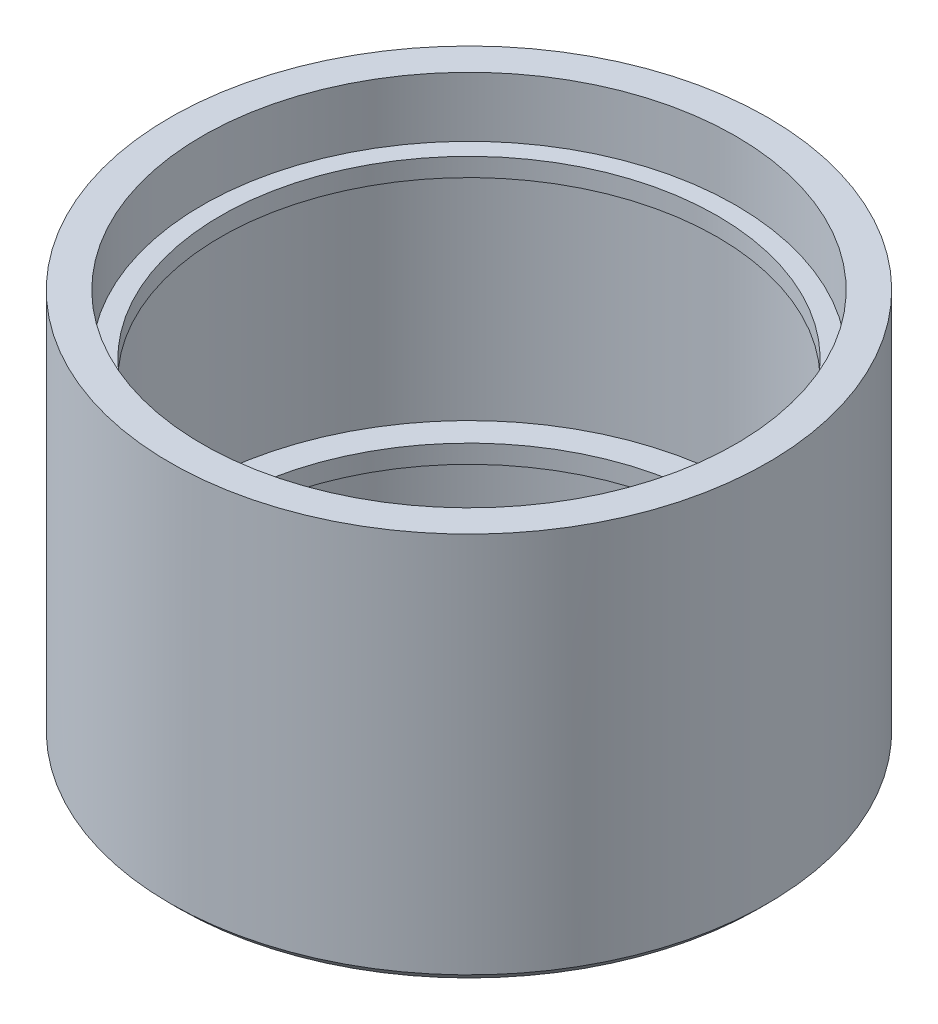
ISO-10303-21;
HEADER;
FILE_DESCRIPTION(('STEP AP214'),'2;1');
FILE_NAME('part.step','',(''),(''),'','','');
FILE_SCHEMA(('AUTOMOTIVE_DESIGN { 1 0 10303 214 1 1 1 1 }'));
ENDSEC;
DATA;
#1=APPLICATION_CONTEXT('core data for automotive mechanical design processes');
#2=APPLICATION_PROTOCOL_DEFINITION('international standard','automotive_design',2000,#1);
#3=PRODUCT_CONTEXT('',#1,'mechanical');
#4=PRODUCT('Part','Part','',(#3));
#5=PRODUCT_RELATED_PRODUCT_CATEGORY('part','',(#4));
#6=PRODUCT_DEFINITION_FORMATION('','',#4);
#7=PRODUCT_DEFINITION_CONTEXT('part definition',#1,'design');
#8=PRODUCT_DEFINITION('design','',#6,#7);
#9=PRODUCT_DEFINITION_SHAPE('','',#8);
#10=(LENGTH_UNIT() NAMED_UNIT(*) SI_UNIT(.MILLI.,.METRE.));
#11=(NAMED_UNIT(*) PLANE_ANGLE_UNIT() SI_UNIT($,.RADIAN.));
#12=(NAMED_UNIT(*) SI_UNIT($,.STERADIAN.) SOLID_ANGLE_UNIT());
#13=UNCERTAINTY_MEASURE_WITH_UNIT(LENGTH_MEASURE(1.E-05),#10,'distance_accuracy_value','');
#14=(GEOMETRIC_REPRESENTATION_CONTEXT(3) GLOBAL_UNCERTAINTY_ASSIGNED_CONTEXT((#13)) GLOBAL_UNIT_ASSIGNED_CONTEXT((#10,
#11,#12)) REPRESENTATION_CONTEXT('',''));
#15=CARTESIAN_POINT('',(0.,0.,0.));
#16=DIRECTION('',(0.,0.,1.));
#17=DIRECTION('',(1.,0.,0.));
#18=AXIS2_PLACEMENT_3D('',#15,#16,#17);
#19=CARTESIAN_POINT('',(0.,-21.25,29.));
#20=DIRECTION('',(0.,1.,0.));
#21=DIRECTION('',(0.,0.,1.));
#22=AXIS2_PLACEMENT_3D('',#19,#20,#21);
#23=PLANE('',#22);
#24=CARTESIAN_POINT('',(0.,-21.25,0.));
#25=DIRECTION('',(0.,1.,0.));
#26=DIRECTION('',(0.,0.,1.));
#27=AXIS2_PLACEMENT_3D('',#24,#25,#26);
#28=CIRCLE('',#27,31.5);
#29=CARTESIAN_POINT('',(0.,-21.25,31.5));
#30=VERTEX_POINT('',#29);
#31=EDGE_CURVE('E43',#30,#30,#28,.F.);
#32=ORIENTED_EDGE('',*,*,#31,.T.);
#33=EDGE_LOOP('',(#32));
#34=FACE_BOUND('',#33,.T.);
#35=CARTESIAN_POINT('',(0.,-21.25,0.));
#36=DIRECTION('',(0.,-1.,0.));
#37=DIRECTION('',(0.,0.,-1.));
#38=AXIS2_PLACEMENT_3D('',#35,#36,#37);
#39=CIRCLE('',#38,29.);
#40=CARTESIAN_POINT('',(0.,-21.25,-29.));
#41=VERTEX_POINT('',#40);
#42=EDGE_CURVE('E80',#41,#41,#39,.T.);
#43=ORIENTED_EDGE('',*,*,#42,.F.);
#44=EDGE_LOOP('',(#43));
#45=FACE_BOUND('',#44,.T.);
#46=ADVANCED_FACE('F36',(#34,#45),#23,.F.);
#47=CARTESIAN_POINT('',(0.,-21.25,0.));
#48=DIRECTION('',(0.,-1.,0.));
#49=DIRECTION('',(0.,0.,-1.));
#50=AXIS2_PLACEMENT_3D('',#47,#48,#49);
#51=CYLINDRICAL_SURFACE('',#50,32.5);
#52=CARTESIAN_POINT('',(0.,-20.25,0.));
#53=DIRECTION('',(0.,1.,0.));
#54=DIRECTION('',(0.,0.,1.));
#55=AXIS2_PLACEMENT_3D('',#52,#53,#54);
#56=CIRCLE('',#55,32.5);
#57=CARTESIAN_POINT('',(0.,-20.25,32.5));
#58=VERTEX_POINT('',#57);
#59=EDGE_CURVE('E10',#58,#58,#56,.T.);
#60=ORIENTED_EDGE('',*,*,#59,.T.);
#61=EDGE_LOOP('',(#60));
#62=FACE_BOUND('',#61,.T.);
#63=CARTESIAN_POINT('',(0.,21.25,0.));
#64=DIRECTION('',(0.,-1.,0.));
#65=DIRECTION('',(0.,0.,-1.));
#66=AXIS2_PLACEMENT_3D('',#63,#64,#65);
#67=CIRCLE('',#66,32.5);
#68=CARTESIAN_POINT('',(0.,21.25,-32.5));
#69=VERTEX_POINT('',#68);
#70=EDGE_CURVE('E47',#69,#69,#67,.T.);
#71=ORIENTED_EDGE('',*,*,#70,.T.);
#72=EDGE_LOOP('',(#71));
#73=FACE_BOUND('',#72,.T.);
#74=ADVANCED_FACE('F87',(#62,#73),#51,.T.);
#75=CARTESIAN_POINT('',(0.,21.25,32.5));
#76=DIRECTION('',(0.,-1.,0.));
#77=DIRECTION('',(0.,0.,-1.));
#78=AXIS2_PLACEMENT_3D('',#75,#76,#77);
#79=PLANE('',#78);
#80=ORIENTED_EDGE('',*,*,#70,.F.);
#81=EDGE_LOOP('',(#80));
#82=FACE_BOUND('',#81,.T.);
#83=CARTESIAN_POINT('',(0.,21.25,0.));
#84=DIRECTION('',(0.,-1.,0.));
#85=DIRECTION('',(0.,0.,-1.));
#86=AXIS2_PLACEMENT_3D('',#83,#84,#85);
#87=CIRCLE('',#86,29.);
#88=CARTESIAN_POINT('',(0.,21.25,-29.));
#89=VERTEX_POINT('',#88);
#90=EDGE_CURVE('E51',#89,#89,#87,.T.);
#91=ORIENTED_EDGE('',*,*,#90,.T.);
#92=EDGE_LOOP('',(#91));
#93=FACE_BOUND('',#92,.T.);
#94=ADVANCED_FACE('F91',(#82,#93),#79,.F.);
#95=CARTESIAN_POINT('',(0.,-21.25,0.));
#96=DIRECTION('',(0.,-1.,0.));
#97=DIRECTION('',(0.,0.,-1.));
#98=AXIS2_PLACEMENT_3D('',#95,#96,#97);
#99=CYLINDRICAL_SURFACE('',#98,29.);
#100=ORIENTED_EDGE('',*,*,#90,.F.);
#101=EDGE_LOOP('',(#100));
#102=FACE_BOUND('',#101,.T.);
#103=CARTESIAN_POINT('',(0.,14.75,0.));
#104=DIRECTION('',(0.,-1.,0.));
#105=DIRECTION('',(0.,0.,-1.));
#106=AXIS2_PLACEMENT_3D('',#103,#104,#105);
#107=CIRCLE('',#106,29.);
#108=CARTESIAN_POINT('',(0.,14.75,-29.));
#109=VERTEX_POINT('',#108);
#110=EDGE_CURVE('E56',#109,#109,#107,.T.);
#111=ORIENTED_EDGE('',*,*,#110,.T.);
#112=EDGE_LOOP('',(#111));
#113=FACE_BOUND('',#112,.T.);
#114=ADVANCED_FACE('F96',(#102,#113),#99,.F.);
#115=CARTESIAN_POINT('',(0.,14.75,29.));
#116=DIRECTION('',(0.,-1.,0.));
#117=DIRECTION('',(0.,0.,-1.));
#118=AXIS2_PLACEMENT_3D('',#115,#116,#117);
#119=PLANE('',#118);
#120=ORIENTED_EDGE('',*,*,#110,.F.);
#121=EDGE_LOOP('',(#120));
#122=FACE_BOUND('',#121,.T.);
#123=CARTESIAN_POINT('',(0.,14.75,0.));
#124=DIRECTION('',(0.,-1.,0.));
#125=DIRECTION('',(0.,0.,-1.));
#126=AXIS2_PLACEMENT_3D('',#123,#124,#125);
#127=CIRCLE('',#126,27.);
#128=CARTESIAN_POINT('',(0.,14.75,-27.));
#129=VERTEX_POINT('',#128);
#130=EDGE_CURVE('E59',#129,#129,#127,.T.);
#131=ORIENTED_EDGE('',*,*,#130,.T.);
#132=EDGE_LOOP('',(#131));
#133=FACE_BOUND('',#132,.T.);
#134=ADVANCED_FACE('F100',(#122,#133),#119,.F.);
#135=CARTESIAN_POINT('',(0.,-21.25,0.));
#136=DIRECTION('',(0.,-1.,0.));
#137=DIRECTION('',(0.,0.,-1.));
#138=AXIS2_PLACEMENT_3D('',#135,#136,#137);
#139=CYLINDRICAL_SURFACE('',#138,27.);
#140=ORIENTED_EDGE('',*,*,#130,.F.);
#141=EDGE_LOOP('',(#140));
#142=FACE_BOUND('',#141,.T.);
#143=CARTESIAN_POINT('',(0.,12.75,0.));
#144=DIRECTION('',(0.,-1.,0.));
#145=DIRECTION('',(0.,0.,-1.));
#146=AXIS2_PLACEMENT_3D('',#143,#144,#145);
#147=CIRCLE('',#146,27.);
#148=CARTESIAN_POINT('',(0.,12.75,-27.));
#149=VERTEX_POINT('',#148);
#150=EDGE_CURVE('E62',#149,#149,#147,.T.);
#151=ORIENTED_EDGE('',*,*,#150,.T.);
#152=EDGE_LOOP('',(#151));
#153=FACE_BOUND('',#152,.T.);
#154=ADVANCED_FACE('F104',(#142,#153),#139,.F.);
#155=CARTESIAN_POINT('',(0.,12.75,27.));
#156=DIRECTION('',(0.,1.,0.));
#157=DIRECTION('',(0.,0.,1.));
#158=AXIS2_PLACEMENT_3D('',#155,#156,#157);
#159=PLANE('',#158);
#160=ORIENTED_EDGE('',*,*,#150,.F.);
#161=EDGE_LOOP('',(#160));
#162=FACE_BOUND('',#161,.T.);
#163=CARTESIAN_POINT('',(0.,12.75,0.));
#164=DIRECTION('',(0.,-1.,0.));
#165=DIRECTION('',(0.,0.,-1.));
#166=AXIS2_PLACEMENT_3D('',#163,#164,#165);
#167=CIRCLE('',#166,30.);
#168=CARTESIAN_POINT('',(0.,12.75,-30.));
#169=VERTEX_POINT('',#168);
#170=EDGE_CURVE('E65',#169,#169,#167,.T.);
#171=ORIENTED_EDGE('',*,*,#170,.T.);
#172=EDGE_LOOP('',(#171));
#173=FACE_BOUND('',#172,.T.);
#174=ADVANCED_FACE('F108',(#162,#173),#159,.F.);
#175=CARTESIAN_POINT('',(0.,-21.25,0.));
#176=DIRECTION('',(0.,-1.,0.));
#177=DIRECTION('',(0.,0.,-1.));
#178=AXIS2_PLACEMENT_3D('',#175,#176,#177);
#179=CYLINDRICAL_SURFACE('',#178,30.);
#180=ORIENTED_EDGE('',*,*,#170,.F.);
#181=EDGE_LOOP('',(#180));
#182=FACE_BOUND('',#181,.T.);
#183=CARTESIAN_POINT('',(0.,-12.25,0.));
#184=DIRECTION('',(0.,-1.,0.));
#185=DIRECTION('',(0.,0.,-1.));
#186=AXIS2_PLACEMENT_3D('',#183,#184,#185);
#187=CIRCLE('',#186,30.);
#188=CARTESIAN_POINT('',(0.,-12.25,-30.));
#189=VERTEX_POINT('',#188);
#190=EDGE_CURVE('E68',#189,#189,#187,.T.);
#191=ORIENTED_EDGE('',*,*,#190,.T.);
#192=EDGE_LOOP('',(#191));
#193=FACE_BOUND('',#192,.T.);
#194=ADVANCED_FACE('F112',(#182,#193),#179,.F.);
#195=CARTESIAN_POINT('',(0.,-12.25,30.));
#196=DIRECTION('',(0.,-1.,0.));
#197=DIRECTION('',(0.,0.,-1.));
#198=AXIS2_PLACEMENT_3D('',#195,#196,#197);
#199=PLANE('',#198);
#200=ORIENTED_EDGE('',*,*,#190,.F.);
#201=EDGE_LOOP('',(#200));
#202=FACE_BOUND('',#201,.T.);
#203=CARTESIAN_POINT('',(0.,-12.25,0.));
#204=DIRECTION('',(0.,-1.,0.));
#205=DIRECTION('',(0.,0.,-1.));
#206=AXIS2_PLACEMENT_3D('',#203,#204,#205);
#207=CIRCLE('',#206,27.);
#208=CARTESIAN_POINT('',(0.,-12.25,-27.));
#209=VERTEX_POINT('',#208);
#210=EDGE_CURVE('E71',#209,#209,#207,.T.);
#211=ORIENTED_EDGE('',*,*,#210,.T.);
#212=EDGE_LOOP('',(#211));
#213=FACE_BOUND('',#212,.T.);
#214=ADVANCED_FACE('F116',(#202,#213),#199,.F.);
#215=CARTESIAN_POINT('',(0.,-21.25,0.));
#216=DIRECTION('',(0.,-1.,0.));
#217=DIRECTION('',(0.,0.,-1.));
#218=AXIS2_PLACEMENT_3D('',#215,#216,#217);
#219=CYLINDRICAL_SURFACE('',#218,27.);
#220=ORIENTED_EDGE('',*,*,#210,.F.);
#221=EDGE_LOOP('',(#220));
#222=FACE_BOUND('',#221,.T.);
#223=CARTESIAN_POINT('',(0.,-14.25,0.));
#224=DIRECTION('',(0.,-1.,0.));
#225=DIRECTION('',(0.,0.,-1.));
#226=AXIS2_PLACEMENT_3D('',#223,#224,#225);
#227=CIRCLE('',#226,27.);
#228=CARTESIAN_POINT('',(0.,-14.25,-27.));
#229=VERTEX_POINT('',#228);
#230=EDGE_CURVE('E74',#229,#229,#227,.T.);
#231=ORIENTED_EDGE('',*,*,#230,.T.);
#232=EDGE_LOOP('',(#231));
#233=FACE_BOUND('',#232,.T.);
#234=ADVANCED_FACE('F120',(#222,#233),#219,.F.);
#235=CARTESIAN_POINT('',(0.,-14.25,29.));
#236=DIRECTION('',(0.,1.,0.));
#237=DIRECTION('',(0.,0.,1.));
#238=AXIS2_PLACEMENT_3D('',#235,#236,#237);
#239=PLANE('',#238);
#240=ORIENTED_EDGE('',*,*,#230,.F.);
#241=EDGE_LOOP('',(#240));
#242=FACE_BOUND('',#241,.T.);
#243=CARTESIAN_POINT('',(0.,-14.25,0.));
#244=DIRECTION('',(0.,-1.,0.));
#245=DIRECTION('',(0.,0.,-1.));
#246=AXIS2_PLACEMENT_3D('',#243,#244,#245);
#247=CIRCLE('',#246,29.);
#248=CARTESIAN_POINT('',(0.,-14.25,-29.));
#249=VERTEX_POINT('',#248);
#250=EDGE_CURVE('E77',#249,#249,#247,.T.);
#251=ORIENTED_EDGE('',*,*,#250,.T.);
#252=EDGE_LOOP('',(#251));
#253=FACE_BOUND('',#252,.T.);
#254=ADVANCED_FACE('F124',(#242,#253),#239,.F.);
#255=CARTESIAN_POINT('',(0.,-21.25,0.));
#256=DIRECTION('',(0.,-1.,0.));
#257=DIRECTION('',(0.,0.,-1.));
#258=AXIS2_PLACEMENT_3D('',#255,#256,#257);
#259=CYLINDRICAL_SURFACE('',#258,29.);
#260=ORIENTED_EDGE('',*,*,#250,.F.);
#261=EDGE_LOOP('',(#260));
#262=FACE_BOUND('',#261,.T.);
#263=ORIENTED_EDGE('',*,*,#42,.T.);
#264=EDGE_LOOP('',(#263));
#265=FACE_BOUND('',#264,.T.);
#266=ADVANCED_FACE('F84',(#262,#265),#259,.F.);
#267=CARTESIAN_POINT('',(0.,-21.25,0.));
#268=DIRECTION('',(0.,1.,0.));
#269=DIRECTION('',(0.,0.,1.));
#270=AXIS2_PLACEMENT_3D('',#267,#268,#269);
#271=CONICAL_SURFACE('',#270,31.5,0.785398163397445);
#272=ORIENTED_EDGE('',*,*,#59,.F.);
#273=EDGE_LOOP('',(#272));
#274=FACE_BOUND('',#273,.T.);
#275=ORIENTED_EDGE('',*,*,#31,.F.);
#276=EDGE_LOOP('',(#275));
#277=FACE_BOUND('',#276,.T.);
#278=ADVANCED_FACE('F38',(#274,#277),#271,.T.);
#279=CLOSED_SHELL('',(#46,#74,#94,#114,#134,#154,#174,#194,#214,#234,#254,#266,#278));
#280=MANIFOLD_SOLID_BREP('B2',#279);
#281=ADVANCED_BREP_SHAPE_REPRESENTATION('',(#18,#280),#14);
#282=SHAPE_DEFINITION_REPRESENTATION(#9,#281);
ENDSEC;
END-ISO-10303-21;
